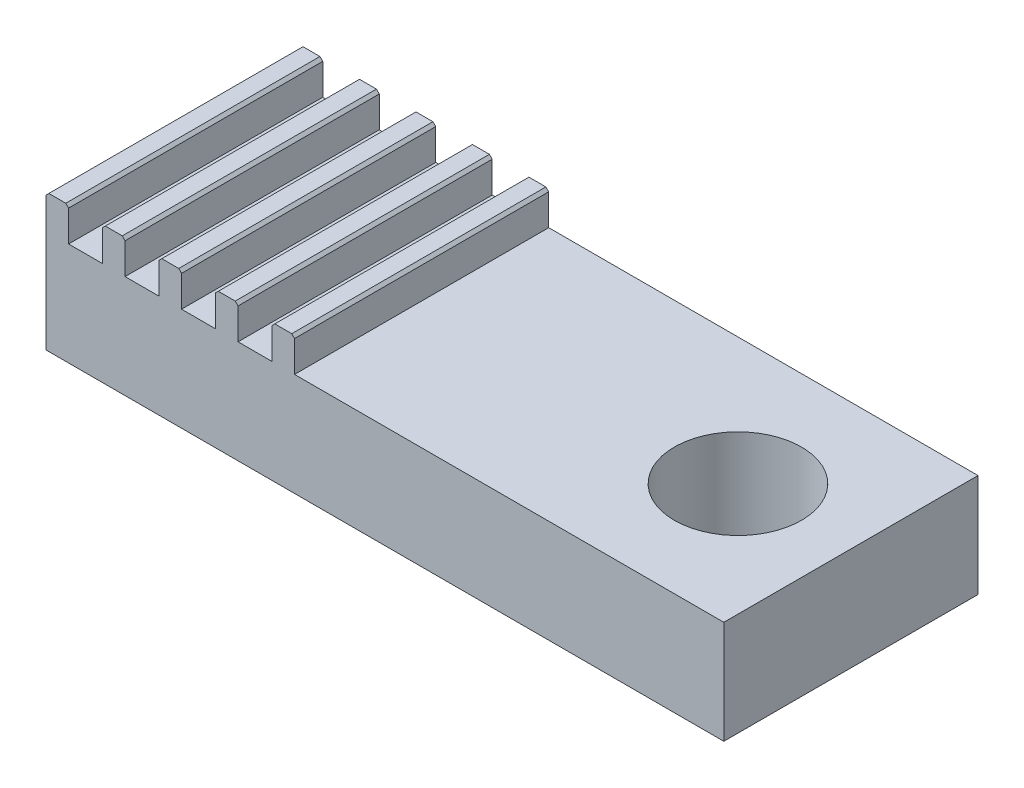
ISO-10303-21;
HEADER;
FILE_DESCRIPTION(('STEP AP214'),'2;1');
FILE_NAME('part.step','',(''),(''),'','','');
FILE_SCHEMA(('AUTOMOTIVE_DESIGN { 1 0 10303 214 1 1 1 1 }'));
ENDSEC;
DATA;
#1=APPLICATION_CONTEXT('core data for automotive mechanical design processes');
#2=APPLICATION_PROTOCOL_DEFINITION('international standard','automotive_design',2000,#1);
#3=PRODUCT_CONTEXT('',#1,'mechanical');
#4=PRODUCT('Part','Part','',(#3));
#5=PRODUCT_RELATED_PRODUCT_CATEGORY('part','',(#4));
#6=PRODUCT_DEFINITION_FORMATION('','',#4);
#7=PRODUCT_DEFINITION_CONTEXT('part definition',#1,'design');
#8=PRODUCT_DEFINITION('design','',#6,#7);
#9=PRODUCT_DEFINITION_SHAPE('','',#8);
#10=(LENGTH_UNIT() NAMED_UNIT(*) SI_UNIT(.MILLI.,.METRE.));
#11=(NAMED_UNIT(*) PLANE_ANGLE_UNIT() SI_UNIT($,.RADIAN.));
#12=(NAMED_UNIT(*) SI_UNIT($,.STERADIAN.) SOLID_ANGLE_UNIT());
#13=UNCERTAINTY_MEASURE_WITH_UNIT(LENGTH_MEASURE(1.E-05),#10,'distance_accuracy_value','');
#14=(GEOMETRIC_REPRESENTATION_CONTEXT(3) GLOBAL_UNCERTAINTY_ASSIGNED_CONTEXT((#13)) GLOBAL_UNIT_ASSIGNED_CONTEXT((#10,
#11,#12)) REPRESENTATION_CONTEXT('',''));
#15=CARTESIAN_POINT('',(0.,0.,0.));
#16=DIRECTION('',(0.,0.,1.));
#17=DIRECTION('',(1.,0.,0.));
#18=AXIS2_PLACEMENT_3D('',#15,#16,#17);
#19=CARTESIAN_POINT('',(4.,0.,9.));
#20=DIRECTION('',(0.,1.,0.));
#21=DIRECTION('',(0.,0.,1.));
#22=AXIS2_PLACEMENT_3D('',#19,#20,#21);
#23=PLANE('',#22);
#24=CARTESIAN_POINT('',(24.,0.,4.5));
#25=DIRECTION('',(0.,1.,0.));
#26=DIRECTION('',(0.,0.,1.));
#27=AXIS2_PLACEMENT_3D('',#24,#25,#26);
#28=CIRCLE('',#27,2.25);
#29=CARTESIAN_POINT('',(24.,0.,6.75));
#30=VERTEX_POINT('',#29);
#31=EDGE_CURVE('E496',#30,#30,#28,.T.);
#32=ORIENTED_EDGE('',*,*,#31,.T.);
#33=EDGE_LOOP('',(#32));
#34=FACE_BOUND('',#33,.T.);
#35=DIRECTION('',(1.,0.,0.));
#36=VECTOR('',#35,1.);
#37=CARTESIAN_POINT('',(4.,0.,0.));
#38=LINE('',#37,#36);
#39=CARTESIAN_POINT('',(4.,0.,0.));
#40=VERTEX_POINT('',#39);
#41=CARTESIAN_POINT('',(28.,0.,0.));
#42=VERTEX_POINT('',#41);
#43=EDGE_CURVE('E267',#40,#42,#38,.T.);
#44=ORIENTED_EDGE('',*,*,#43,.T.);
#45=DIRECTION('',(0.,0.,-1.));
#46=VECTOR('',#45,1.);
#47=CARTESIAN_POINT('',(28.,0.,9.));
#48=LINE('',#47,#46);
#49=CARTESIAN_POINT('',(28.,0.,9.));
#50=VERTEX_POINT('',#49);
#51=EDGE_CURVE('E249',#50,#42,#48,.T.);
#52=ORIENTED_EDGE('',*,*,#51,.F.);
#53=DIRECTION('',(1.,0.,0.));
#54=VECTOR('',#53,1.);
#55=CARTESIAN_POINT('',(4.,0.,9.));
#56=LINE('',#55,#54);
#57=CARTESIAN_POINT('',(4.,0.,9.));
#58=VERTEX_POINT('',#57);
#59=EDGE_CURVE('E255',#58,#50,#56,.T.);
#60=ORIENTED_EDGE('',*,*,#59,.F.);
#61=DIRECTION('',(0.,0.,-1.));
#62=VECTOR('',#61,1.);
#63=CARTESIAN_POINT('',(4.,0.,9.));
#64=LINE('',#63,#62);
#65=EDGE_CURVE('E387',#58,#40,#64,.T.);
#66=ORIENTED_EDGE('',*,*,#65,.T.);
#67=EDGE_LOOP('',(#44,#52,#60,#66));
#68=FACE_BOUND('',#67,.T.);
#69=ADVANCED_FACE('F34',(#34,#68),#23,.F.);
#70=CARTESIAN_POINT('',(28.,3.65,9.));
#71=DIRECTION('',(-1.,0.,0.));
#72=DIRECTION('',(0.,0.,1.));
#73=AXIS2_PLACEMENT_3D('',#70,#71,#72);
#74=PLANE('',#73);
#75=DIRECTION('',(0.,1.,0.));
#76=VECTOR('',#75,1.);
#77=CARTESIAN_POINT('',(28.,3.65,0.));
#78=LINE('',#77,#76);
#79=CARTESIAN_POINT('',(28.,3.65,0.));
#80=VERTEX_POINT('',#79);
#81=EDGE_CURVE('E429',#42,#80,#78,.T.);
#82=ORIENTED_EDGE('',*,*,#81,.T.);
#83=DIRECTION('',(0.,0.,-1.));
#84=VECTOR('',#83,1.);
#85=CARTESIAN_POINT('',(28.,3.65,9.));
#86=LINE('',#85,#84);
#87=CARTESIAN_POINT('',(28.,3.65,9.));
#88=VERTEX_POINT('',#87);
#89=EDGE_CURVE('E252',#88,#80,#86,.T.);
#90=ORIENTED_EDGE('',*,*,#89,.F.);
#91=DIRECTION('',(0.,1.,0.));
#92=VECTOR('',#91,1.);
#93=CARTESIAN_POINT('',(28.,3.65,9.));
#94=LINE('',#93,#92);
#95=EDGE_CURVE('E245',#50,#88,#94,.T.);
#96=ORIENTED_EDGE('',*,*,#95,.F.);
#97=ORIENTED_EDGE('',*,*,#51,.T.);
#98=EDGE_LOOP('',(#82,#90,#96,#97));
#99=FACE_BOUND('',#98,.T.);
#100=ADVANCED_FACE('F247',(#99),#74,.F.);
#101=CARTESIAN_POINT('',(12.8,3.65,9.));
#102=DIRECTION('',(0.,-1.,0.));
#103=DIRECTION('',(1.,0.,0.));
#104=AXIS2_PLACEMENT_3D('',#101,#102,#103);
#105=PLANE('',#104);
#106=CARTESIAN_POINT('',(24.,3.65,4.5));
#107=DIRECTION('',(0.,1.,0.));
#108=DIRECTION('',(0.,0.,1.));
#109=AXIS2_PLACEMENT_3D('',#106,#107,#108);
#110=CIRCLE('',#109,2.25);
#111=CARTESIAN_POINT('',(24.,3.65,6.75));
#112=VERTEX_POINT('',#111);
#113=EDGE_CURVE('E683',#112,#112,#110,.T.);
#114=ORIENTED_EDGE('',*,*,#113,.F.);
#115=EDGE_LOOP('',(#114));
#116=FACE_BOUND('',#115,.T.);
#117=DIRECTION('',(-1.,0.,0.));
#118=VECTOR('',#117,1.);
#119=CARTESIAN_POINT('',(12.8,3.65,0.));
#120=LINE('',#119,#118);
#121=CARTESIAN_POINT('',(12.8,3.65,0.));
#122=VERTEX_POINT('',#121);
#123=EDGE_CURVE('E423',#80,#122,#120,.T.);
#124=ORIENTED_EDGE('',*,*,#123,.T.);
#125=DIRECTION('',(0.,0.,-1.));
#126=VECTOR('',#125,1.);
#127=CARTESIAN_POINT('',(12.8,3.65,9.));
#128=LINE('',#127,#126);
#129=CARTESIAN_POINT('',(12.8,3.65,9.));
#130=VERTEX_POINT('',#129);
#131=EDGE_CURVE('E272',#130,#122,#128,.T.);
#132=ORIENTED_EDGE('',*,*,#131,.F.);
#133=DIRECTION('',(-1.,0.,0.));
#134=VECTOR('',#133,1.);
#135=CARTESIAN_POINT('',(12.8,3.65,9.));
#136=LINE('',#135,#134);
#137=EDGE_CURVE('E254',#88,#130,#136,.T.);
#138=ORIENTED_EDGE('',*,*,#137,.F.);
#139=ORIENTED_EDGE('',*,*,#89,.T.);
#140=EDGE_LOOP('',(#124,#132,#138,#139));
#141=FACE_BOUND('',#140,.T.);
#142=ADVANCED_FACE('F497',(#116,#141),#105,.F.);
#143=CARTESIAN_POINT('',(12.8,4.85,9.));
#144=DIRECTION('',(-1.,0.,0.));
#145=DIRECTION('',(0.,-1.,0.));
#146=AXIS2_PLACEMENT_3D('',#143,#144,#145);
#147=PLANE('',#146);
#148=DIRECTION('',(0.,1.,0.));
#149=VECTOR('',#148,1.);
#150=CARTESIAN_POINT('',(12.8,4.85,0.));
#151=LINE('',#150,#149);
#152=CARTESIAN_POINT('',(12.8,4.75,0.));
#153=VERTEX_POINT('',#152);
#154=EDGE_CURVE('E418',#122,#153,#151,.T.);
#155=ORIENTED_EDGE('',*,*,#154,.T.);
#156=DIRECTION('',(0.,0.,1.));
#157=VECTOR('',#156,1.);
#158=CARTESIAN_POINT('',(12.8,4.75,9.));
#159=LINE('',#158,#157);
#160=CARTESIAN_POINT('',(12.8,4.75,9.));
#161=VERTEX_POINT('',#160);
#162=EDGE_CURVE('E298',#153,#161,#159,.T.);
#163=ORIENTED_EDGE('',*,*,#162,.T.);
#164=DIRECTION('',(0.,1.,0.));
#165=VECTOR('',#164,1.);
#166=CARTESIAN_POINT('',(12.8,4.85,9.));
#167=LINE('',#166,#165);
#168=EDGE_CURVE('E420',#130,#161,#167,.T.);
#169=ORIENTED_EDGE('',*,*,#168,.F.);
#170=ORIENTED_EDGE('',*,*,#131,.T.);
#171=EDGE_LOOP('',(#155,#163,#169,#170));
#172=FACE_BOUND('',#171,.T.);
#173=ADVANCED_FACE('F417',(#172),#147,.F.);
#174=CARTESIAN_POINT('',(12.,4.85,9.));
#175=DIRECTION('',(0.,-1.,0.));
#176=DIRECTION('',(0.,0.,-1.));
#177=AXIS2_PLACEMENT_3D('',#174,#175,#176);
#178=PLANE('',#177);
#179=DIRECTION('',(-1.,0.,0.));
#180=VECTOR('',#179,1.);
#181=CARTESIAN_POINT('',(12.,4.85,9.));
#182=LINE('',#181,#180);
#183=CARTESIAN_POINT('',(12.7,4.85,9.));
#184=VERTEX_POINT('',#183);
#185=CARTESIAN_POINT('',(12.1,4.85,9.));
#186=VERTEX_POINT('',#185);
#187=EDGE_CURVE('E499',#184,#186,#182,.T.);
#188=ORIENTED_EDGE('',*,*,#187,.F.);
#189=DIRECTION('',(0.,0.,-1.));
#190=VECTOR('',#189,1.);
#191=CARTESIAN_POINT('',(12.7,4.85,9.));
#192=LINE('',#191,#190);
#193=CARTESIAN_POINT('',(12.7,4.85,0.));
#194=VERTEX_POINT('',#193);
#195=EDGE_CURVE('E270',#184,#194,#192,.T.);
#196=ORIENTED_EDGE('',*,*,#195,.T.);
#197=DIRECTION('',(-1.,0.,0.));
#198=VECTOR('',#197,1.);
#199=CARTESIAN_POINT('',(12.,4.85,0.));
#200=LINE('',#199,#198);
#201=CARTESIAN_POINT('',(12.1,4.85,0.));
#202=VERTEX_POINT('',#201);
#203=EDGE_CURVE('E424',#194,#202,#200,.T.);
#204=ORIENTED_EDGE('',*,*,#203,.T.);
#205=DIRECTION('',(0.,0.,1.));
#206=VECTOR('',#205,1.);
#207=CARTESIAN_POINT('',(12.1,4.85,9.));
#208=LINE('',#207,#206);
#209=EDGE_CURVE('E268',#202,#186,#208,.T.);
#210=ORIENTED_EDGE('',*,*,#209,.T.);
#211=EDGE_LOOP('',(#188,#196,#204,#210));
#212=FACE_BOUND('',#211,.T.);
#213=ADVANCED_FACE('F605',(#212),#178,.F.);
#214=CARTESIAN_POINT('',(12.,3.65,9.));
#215=DIRECTION('',(1.,0.,0.));
#216=DIRECTION('',(0.,1.,0.));
#217=AXIS2_PLACEMENT_3D('',#214,#215,#216);
#218=PLANE('',#217);
#219=DIRECTION('',(0.,-1.,0.));
#220=VECTOR('',#219,1.);
#221=CARTESIAN_POINT('',(12.,3.65,9.));
#222=LINE('',#221,#220);
#223=CARTESIAN_POINT('',(12.,4.75,9.));
#224=VERTEX_POINT('',#223);
#225=CARTESIAN_POINT('',(12.,3.65,9.));
#226=VERTEX_POINT('',#225);
#227=EDGE_CURVE('E504',#224,#226,#222,.T.);
#228=ORIENTED_EDGE('',*,*,#227,.F.);
#229=DIRECTION('',(0.,0.,-1.));
#230=VECTOR('',#229,1.);
#231=CARTESIAN_POINT('',(12.,4.75,9.));
#232=LINE('',#231,#230);
#233=CARTESIAN_POINT('',(12.,4.75,0.));
#234=VERTEX_POINT('',#233);
#235=EDGE_CURVE('E319',#224,#234,#232,.T.);
#236=ORIENTED_EDGE('',*,*,#235,.T.);
#237=DIRECTION('',(0.,-1.,0.));
#238=VECTOR('',#237,1.);
#239=CARTESIAN_POINT('',(12.,3.65,0.));
#240=LINE('',#239,#238);
#241=CARTESIAN_POINT('',(12.,3.65,0.));
#242=VERTEX_POINT('',#241);
#243=EDGE_CURVE('E427',#234,#242,#240,.T.);
#244=ORIENTED_EDGE('',*,*,#243,.T.);
#245=DIRECTION('',(0.,0.,-1.));
#246=VECTOR('',#245,1.);
#247=CARTESIAN_POINT('',(12.,3.65,9.));
#248=LINE('',#247,#246);
#249=EDGE_CURVE('E409',#226,#242,#248,.T.);
#250=ORIENTED_EDGE('',*,*,#249,.F.);
#251=EDGE_LOOP('',(#228,#236,#244,#250));
#252=FACE_BOUND('',#251,.T.);
#253=ADVANCED_FACE('F597',(#252),#218,.F.);
#254=CARTESIAN_POINT('',(10.8,3.65,9.));
#255=DIRECTION('',(0.,-1.,0.));
#256=DIRECTION('',(0.,0.,-1.));
#257=AXIS2_PLACEMENT_3D('',#254,#255,#256);
#258=PLANE('',#257);
#259=DIRECTION('',(-1.,0.,0.));
#260=VECTOR('',#259,1.);
#261=CARTESIAN_POINT('',(10.8,3.65,0.));
#262=LINE('',#261,#260);
#263=CARTESIAN_POINT('',(10.8,3.65,0.));
#264=VERTEX_POINT('',#263);
#265=EDGE_CURVE('E434',#242,#264,#262,.T.);
#266=ORIENTED_EDGE('',*,*,#265,.T.);
#267=DIRECTION('',(0.,0.,-1.));
#268=VECTOR('',#267,1.);
#269=CARTESIAN_POINT('',(10.8,3.65,9.));
#270=LINE('',#269,#268);
#271=CARTESIAN_POINT('',(10.8,3.65,9.));
#272=VERTEX_POINT('',#271);
#273=EDGE_CURVE('E406',#272,#264,#270,.T.);
#274=ORIENTED_EDGE('',*,*,#273,.F.);
#275=DIRECTION('',(-1.,0.,0.));
#276=VECTOR('',#275,1.);
#277=CARTESIAN_POINT('',(10.8,3.65,9.));
#278=LINE('',#277,#276);
#279=EDGE_CURVE('E506',#226,#272,#278,.T.);
#280=ORIENTED_EDGE('',*,*,#279,.F.);
#281=ORIENTED_EDGE('',*,*,#249,.T.);
#282=EDGE_LOOP('',(#266,#274,#280,#281));
#283=FACE_BOUND('',#282,.T.);
#284=ADVANCED_FACE('F592',(#283),#258,.F.);
#285=CARTESIAN_POINT('',(10.8,4.85,9.));
#286=DIRECTION('',(-1.,0.,0.));
#287=DIRECTION('',(0.,-1.,0.));
#288=AXIS2_PLACEMENT_3D('',#285,#286,#287);
#289=PLANE('',#288);
#290=DIRECTION('',(0.,1.,0.));
#291=VECTOR('',#290,1.);
#292=CARTESIAN_POINT('',(10.8,4.85,0.));
#293=LINE('',#292,#291);
#294=CARTESIAN_POINT('',(10.8,4.75,0.));
#295=VERTEX_POINT('',#294);
#296=EDGE_CURVE('E436',#264,#295,#293,.T.);
#297=ORIENTED_EDGE('',*,*,#296,.T.);
#298=DIRECTION('',(0.,0.,1.));
#299=VECTOR('',#298,1.);
#300=CARTESIAN_POINT('',(10.8,4.75,9.));
#301=LINE('',#300,#299);
#302=CARTESIAN_POINT('',(10.8,4.75,9.));
#303=VERTEX_POINT('',#302);
#304=EDGE_CURVE('E327',#295,#303,#301,.T.);
#305=ORIENTED_EDGE('',*,*,#304,.T.);
#306=DIRECTION('',(0.,1.,0.));
#307=VECTOR('',#306,1.);
#308=CARTESIAN_POINT('',(10.8,4.85,9.));
#309=LINE('',#308,#307);
#310=EDGE_CURVE('E508',#272,#303,#309,.T.);
#311=ORIENTED_EDGE('',*,*,#310,.F.);
#312=ORIENTED_EDGE('',*,*,#273,.T.);
#313=EDGE_LOOP('',(#297,#305,#311,#312));
#314=FACE_BOUND('',#313,.T.);
#315=ADVANCED_FACE('F588',(#314),#289,.F.);
#316=CARTESIAN_POINT('',(10.,4.85,9.));
#317=DIRECTION('',(0.,-1.,0.));
#318=DIRECTION('',(0.,0.,-1.));
#319=AXIS2_PLACEMENT_3D('',#316,#317,#318);
#320=PLANE('',#319);
#321=DIRECTION('',(-1.,0.,0.));
#322=VECTOR('',#321,1.);
#323=CARTESIAN_POINT('',(10.,4.85,9.));
#324=LINE('',#323,#322);
#325=CARTESIAN_POINT('',(10.7,4.85,9.));
#326=VERTEX_POINT('',#325);
#327=CARTESIAN_POINT('',(10.1,4.85,9.));
#328=VERTEX_POINT('',#327);
#329=EDGE_CURVE('E511',#326,#328,#324,.T.);
#330=ORIENTED_EDGE('',*,*,#329,.F.);
#331=DIRECTION('',(0.,0.,-1.));
#332=VECTOR('',#331,1.);
#333=CARTESIAN_POINT('',(10.7,4.85,9.));
#334=LINE('',#333,#332);
#335=CARTESIAN_POINT('',(10.7,4.85,0.));
#336=VERTEX_POINT('',#335);
#337=EDGE_CURVE('E324',#326,#336,#334,.T.);
#338=ORIENTED_EDGE('',*,*,#337,.T.);
#339=DIRECTION('',(-1.,0.,0.));
#340=VECTOR('',#339,1.);
#341=CARTESIAN_POINT('',(10.,4.85,0.));
#342=LINE('',#341,#340);
#343=CARTESIAN_POINT('',(10.1,4.85,0.));
#344=VERTEX_POINT('',#343);
#345=EDGE_CURVE('E439',#336,#344,#342,.T.);
#346=ORIENTED_EDGE('',*,*,#345,.T.);
#347=DIRECTION('',(0.,0.,1.));
#348=VECTOR('',#347,1.);
#349=CARTESIAN_POINT('',(10.1,4.85,9.));
#350=LINE('',#349,#348);
#351=EDGE_CURVE('E322',#344,#328,#350,.T.);
#352=ORIENTED_EDGE('',*,*,#351,.T.);
#353=EDGE_LOOP('',(#330,#338,#346,#352));
#354=FACE_BOUND('',#353,.T.);
#355=ADVANCED_FACE('F578',(#354),#320,.F.);
#356=CARTESIAN_POINT('',(10.,3.65,9.));
#357=DIRECTION('',(1.,0.,0.));
#358=DIRECTION('',(0.,0.,-1.));
#359=AXIS2_PLACEMENT_3D('',#356,#357,#358);
#360=PLANE('',#359);
#361=DIRECTION('',(0.,-1.,0.));
#362=VECTOR('',#361,1.);
#363=CARTESIAN_POINT('',(10.,3.65,9.));
#364=LINE('',#363,#362);
#365=CARTESIAN_POINT('',(10.,4.75,9.));
#366=VERTEX_POINT('',#365);
#367=CARTESIAN_POINT('',(10.,3.65,9.));
#368=VERTEX_POINT('',#367);
#369=EDGE_CURVE('E514',#366,#368,#364,.T.);
#370=ORIENTED_EDGE('',*,*,#369,.F.);
#371=DIRECTION('',(0.,0.,-1.));
#372=VECTOR('',#371,1.);
#373=CARTESIAN_POINT('',(10.,4.75,9.));
#374=LINE('',#373,#372);
#375=CARTESIAN_POINT('',(10.,4.75000000000001,0.));
#376=VERTEX_POINT('',#375);
#377=EDGE_CURVE('E329',#366,#376,#374,.T.);
#378=ORIENTED_EDGE('',*,*,#377,.T.);
#379=DIRECTION('',(0.,-1.,0.));
#380=VECTOR('',#379,1.);
#381=CARTESIAN_POINT('',(10.,3.65,0.));
#382=LINE('',#381,#380);
#383=CARTESIAN_POINT('',(10.,3.65,0.));
#384=VERTEX_POINT('',#383);
#385=EDGE_CURVE('E442',#376,#384,#382,.T.);
#386=ORIENTED_EDGE('',*,*,#385,.T.);
#387=DIRECTION('',(0.,0.,-1.));
#388=VECTOR('',#387,1.);
#389=CARTESIAN_POINT('',(10.,3.65,9.));
#390=LINE('',#389,#388);
#391=EDGE_CURVE('E403',#368,#384,#390,.T.);
#392=ORIENTED_EDGE('',*,*,#391,.F.);
#393=EDGE_LOOP('',(#370,#378,#386,#392));
#394=FACE_BOUND('',#393,.T.);
#395=ADVANCED_FACE('F570',(#394),#360,.F.);
#396=CARTESIAN_POINT('',(8.8,3.65,9.));
#397=DIRECTION('',(0.,-1.,0.));
#398=DIRECTION('',(1.,0.,0.));
#399=AXIS2_PLACEMENT_3D('',#396,#397,#398);
#400=PLANE('',#399);
#401=DIRECTION('',(-1.,0.,0.));
#402=VECTOR('',#401,1.);
#403=CARTESIAN_POINT('',(8.8,3.65,0.));
#404=LINE('',#403,#402);
#405=CARTESIAN_POINT('',(8.8,3.65,0.));
#406=VERTEX_POINT('',#405);
#407=EDGE_CURVE('E444',#384,#406,#404,.T.);
#408=ORIENTED_EDGE('',*,*,#407,.T.);
#409=DIRECTION('',(0.,0.,-1.));
#410=VECTOR('',#409,1.);
#411=CARTESIAN_POINT('',(8.8,3.65,9.));
#412=LINE('',#411,#410);
#413=CARTESIAN_POINT('',(8.8,3.65,9.));
#414=VERTEX_POINT('',#413);
#415=EDGE_CURVE('E400',#414,#406,#412,.T.);
#416=ORIENTED_EDGE('',*,*,#415,.F.);
#417=DIRECTION('',(-1.,0.,0.));
#418=VECTOR('',#417,1.);
#419=CARTESIAN_POINT('',(8.8,3.65,9.));
#420=LINE('',#419,#418);
#421=EDGE_CURVE('E516',#368,#414,#420,.T.);
#422=ORIENTED_EDGE('',*,*,#421,.F.);
#423=ORIENTED_EDGE('',*,*,#391,.T.);
#424=EDGE_LOOP('',(#408,#416,#422,#423));
#425=FACE_BOUND('',#424,.T.);
#426=ADVANCED_FACE('F564',(#425),#400,.F.);
#427=CARTESIAN_POINT('',(8.8,4.85,9.));
#428=DIRECTION('',(-1.,0.,0.));
#429=DIRECTION('',(0.,0.,1.));
#430=AXIS2_PLACEMENT_3D('',#427,#428,#429);
#431=PLANE('',#430);
#432=DIRECTION('',(0.,1.,0.));
#433=VECTOR('',#432,1.);
#434=CARTESIAN_POINT('',(8.8,4.85,0.));
#435=LINE('',#434,#433);
#436=CARTESIAN_POINT('',(8.8,4.75,0.));
#437=VERTEX_POINT('',#436);
#438=EDGE_CURVE('E446',#406,#437,#435,.T.);
#439=ORIENTED_EDGE('',*,*,#438,.T.);
#440=DIRECTION('',(0.,0.,1.));
#441=VECTOR('',#440,1.);
#442=CARTESIAN_POINT('',(8.8,4.75,9.));
#443=LINE('',#442,#441);
#444=CARTESIAN_POINT('',(8.8,4.75,9.));
#445=VERTEX_POINT('',#444);
#446=EDGE_CURVE('E337',#437,#445,#443,.T.);
#447=ORIENTED_EDGE('',*,*,#446,.T.);
#448=DIRECTION('',(0.,1.,0.));
#449=VECTOR('',#448,1.);
#450=CARTESIAN_POINT('',(8.8,4.85,9.));
#451=LINE('',#450,#449);
#452=EDGE_CURVE('E518',#414,#445,#451,.T.);
#453=ORIENTED_EDGE('',*,*,#452,.F.);
#454=ORIENTED_EDGE('',*,*,#415,.T.);
#455=EDGE_LOOP('',(#439,#447,#453,#454));
#456=FACE_BOUND('',#455,.T.);
#457=ADVANCED_FACE('F560',(#456),#431,.F.);
#458=CARTESIAN_POINT('',(8.,4.85,9.));
#459=DIRECTION('',(0.,-1.,0.));
#460=DIRECTION('',(0.,0.,-1.));
#461=AXIS2_PLACEMENT_3D('',#458,#459,#460);
#462=PLANE('',#461);
#463=DIRECTION('',(-1.,0.,0.));
#464=VECTOR('',#463,1.);
#465=CARTESIAN_POINT('',(8.,4.85,9.));
#466=LINE('',#465,#464);
#467=CARTESIAN_POINT('',(8.7,4.85,9.));
#468=VERTEX_POINT('',#467);
#469=CARTESIAN_POINT('',(8.1,4.85,9.));
#470=VERTEX_POINT('',#469);
#471=EDGE_CURVE('E521',#468,#470,#466,.T.);
#472=ORIENTED_EDGE('',*,*,#471,.F.);
#473=DIRECTION('',(0.,0.,-1.));
#474=VECTOR('',#473,1.);
#475=CARTESIAN_POINT('',(8.7,4.85,9.));
#476=LINE('',#475,#474);
#477=CARTESIAN_POINT('',(8.7,4.85,0.));
#478=VERTEX_POINT('',#477);
#479=EDGE_CURVE('E334',#468,#478,#476,.T.);
#480=ORIENTED_EDGE('',*,*,#479,.T.);
#481=DIRECTION('',(-1.,0.,0.));
#482=VECTOR('',#481,1.);
#483=CARTESIAN_POINT('',(8.,4.85,0.));
#484=LINE('',#483,#482);
#485=CARTESIAN_POINT('',(8.1,4.85,0.));
#486=VERTEX_POINT('',#485);
#487=EDGE_CURVE('E449',#478,#486,#484,.T.);
#488=ORIENTED_EDGE('',*,*,#487,.T.);
#489=DIRECTION('',(0.,0.,1.));
#490=VECTOR('',#489,1.);
#491=CARTESIAN_POINT('',(8.1,4.85,9.));
#492=LINE('',#491,#490);
#493=EDGE_CURVE('E332',#486,#470,#492,.T.);
#494=ORIENTED_EDGE('',*,*,#493,.T.);
#495=EDGE_LOOP('',(#472,#480,#488,#494));
#496=FACE_BOUND('',#495,.T.);
#497=ADVANCED_FACE('F550',(#496),#462,.F.);
#498=CARTESIAN_POINT('',(8.,3.65,9.));
#499=DIRECTION('',(1.,0.,0.));
#500=DIRECTION('',(0.,0.,-1.));
#501=AXIS2_PLACEMENT_3D('',#498,#499,#500);
#502=PLANE('',#501);
#503=DIRECTION('',(0.,-1.,0.));
#504=VECTOR('',#503,1.);
#505=CARTESIAN_POINT('',(8.,3.65,9.));
#506=LINE('',#505,#504);
#507=CARTESIAN_POINT('',(8.,4.75,9.));
#508=VERTEX_POINT('',#507);
#509=CARTESIAN_POINT('',(8.,3.65,9.));
#510=VERTEX_POINT('',#509);
#511=EDGE_CURVE('E524',#508,#510,#506,.T.);
#512=ORIENTED_EDGE('',*,*,#511,.F.);
#513=DIRECTION('',(0.,0.,-1.));
#514=VECTOR('',#513,1.);
#515=CARTESIAN_POINT('',(8.,4.75,9.));
#516=LINE('',#515,#514);
#517=CARTESIAN_POINT('',(8.,4.75,0.));
#518=VERTEX_POINT('',#517);
#519=EDGE_CURVE('E339',#508,#518,#516,.T.);
#520=ORIENTED_EDGE('',*,*,#519,.T.);
#521=DIRECTION('',(0.,-1.,0.));
#522=VECTOR('',#521,1.);
#523=CARTESIAN_POINT('',(8.,3.65,0.));
#524=LINE('',#523,#522);
#525=CARTESIAN_POINT('',(8.,3.65,0.));
#526=VERTEX_POINT('',#525);
#527=EDGE_CURVE('E452',#518,#526,#524,.T.);
#528=ORIENTED_EDGE('',*,*,#527,.T.);
#529=DIRECTION('',(0.,0.,-1.));
#530=VECTOR('',#529,1.);
#531=CARTESIAN_POINT('',(8.,3.65,9.));
#532=LINE('',#531,#530);
#533=EDGE_CURVE('E397',#510,#526,#532,.T.);
#534=ORIENTED_EDGE('',*,*,#533,.F.);
#535=EDGE_LOOP('',(#512,#520,#528,#534));
#536=FACE_BOUND('',#535,.T.);
#537=ADVANCED_FACE('F542',(#536),#502,.F.);
#538=CARTESIAN_POINT('',(6.8,3.65,9.));
#539=DIRECTION('',(0.,-1.,0.));
#540=DIRECTION('',(0.,0.,-1.));
#541=AXIS2_PLACEMENT_3D('',#538,#539,#540);
#542=PLANE('',#541);
#543=DIRECTION('',(-1.,0.,0.));
#544=VECTOR('',#543,1.);
#545=CARTESIAN_POINT('',(6.8,3.65,0.));
#546=LINE('',#545,#544);
#547=CARTESIAN_POINT('',(6.8,3.65,0.));
#548=VERTEX_POINT('',#547);
#549=EDGE_CURVE('E454',#526,#548,#546,.T.);
#550=ORIENTED_EDGE('',*,*,#549,.T.);
#551=DIRECTION('',(0.,0.,-1.));
#552=VECTOR('',#551,1.);
#553=CARTESIAN_POINT('',(6.8,3.65,9.));
#554=LINE('',#553,#552);
#555=CARTESIAN_POINT('',(6.8,3.65,9.));
#556=VERTEX_POINT('',#555);
#557=EDGE_CURVE('E394',#556,#548,#554,.T.);
#558=ORIENTED_EDGE('',*,*,#557,.F.);
#559=DIRECTION('',(-1.,0.,0.));
#560=VECTOR('',#559,1.);
#561=CARTESIAN_POINT('',(6.8,3.65,9.));
#562=LINE('',#561,#560);
#563=EDGE_CURVE('E489',#510,#556,#562,.T.);
#564=ORIENTED_EDGE('',*,*,#563,.F.);
#565=ORIENTED_EDGE('',*,*,#533,.T.);
#566=EDGE_LOOP('',(#550,#558,#564,#565));
#567=FACE_BOUND('',#566,.T.);
#568=ADVANCED_FACE('F531',(#567),#542,.F.);
#569=CARTESIAN_POINT('',(6.8,4.85,9.));
#570=DIRECTION('',(-1.,0.,0.));
#571=DIRECTION('',(0.,0.,1.));
#572=AXIS2_PLACEMENT_3D('',#569,#570,#571);
#573=PLANE('',#572);
#574=DIRECTION('',(0.,1.,0.));
#575=VECTOR('',#574,1.);
#576=CARTESIAN_POINT('',(6.8,4.85,0.));
#577=LINE('',#576,#575);
#578=CARTESIAN_POINT('',(6.8,4.75,0.));
#579=VERTEX_POINT('',#578);
#580=EDGE_CURVE('E456',#548,#579,#577,.T.);
#581=ORIENTED_EDGE('',*,*,#580,.T.);
#582=DIRECTION('',(0.,0.,1.));
#583=VECTOR('',#582,1.);
#584=CARTESIAN_POINT('',(6.8,4.75,9.));
#585=LINE('',#584,#583);
#586=CARTESIAN_POINT('',(6.8,4.75,9.));
#587=VERTEX_POINT('',#586);
#588=EDGE_CURVE('E347',#579,#587,#585,.T.);
#589=ORIENTED_EDGE('',*,*,#588,.T.);
#590=DIRECTION('',(0.,1.,0.));
#591=VECTOR('',#590,1.);
#592=CARTESIAN_POINT('',(6.8,4.85,9.));
#593=LINE('',#592,#591);
#594=EDGE_CURVE('E486',#556,#587,#593,.T.);
#595=ORIENTED_EDGE('',*,*,#594,.F.);
#596=ORIENTED_EDGE('',*,*,#557,.T.);
#597=EDGE_LOOP('',(#581,#589,#595,#596));
#598=FACE_BOUND('',#597,.T.);
#599=ADVANCED_FACE('F535',(#598),#573,.F.);
#600=CARTESIAN_POINT('',(6.,4.85,9.));
#601=DIRECTION('',(0.,-1.,0.));
#602=DIRECTION('',(0.,0.,-1.));
#603=AXIS2_PLACEMENT_3D('',#600,#601,#602);
#604=PLANE('',#603);
#605=DIRECTION('',(-1.,0.,0.));
#606=VECTOR('',#605,1.);
#607=CARTESIAN_POINT('',(6.,4.85,9.));
#608=LINE('',#607,#606);
#609=CARTESIAN_POINT('',(6.7,4.85,9.));
#610=VERTEX_POINT('',#609);
#611=CARTESIAN_POINT('',(6.1,4.85,9.));
#612=VERTEX_POINT('',#611);
#613=EDGE_CURVE('E482',#610,#612,#608,.T.);
#614=ORIENTED_EDGE('',*,*,#613,.F.);
#615=DIRECTION('',(0.,0.,-1.));
#616=VECTOR('',#615,1.);
#617=CARTESIAN_POINT('',(6.7,4.85,9.));
#618=LINE('',#617,#616);
#619=CARTESIAN_POINT('',(6.7,4.85,0.));
#620=VERTEX_POINT('',#619);
#621=EDGE_CURVE('E344',#610,#620,#618,.T.);
#622=ORIENTED_EDGE('',*,*,#621,.T.);
#623=DIRECTION('',(-1.,0.,0.));
#624=VECTOR('',#623,1.);
#625=CARTESIAN_POINT('',(6.,4.85,0.));
#626=LINE('',#625,#624);
#627=CARTESIAN_POINT('',(6.1,4.85,0.));
#628=VERTEX_POINT('',#627);
#629=EDGE_CURVE('E459',#620,#628,#626,.T.);
#630=ORIENTED_EDGE('',*,*,#629,.T.);
#631=DIRECTION('',(0.,0.,1.));
#632=VECTOR('',#631,1.);
#633=CARTESIAN_POINT('',(6.1,4.85,9.));
#634=LINE('',#633,#632);
#635=EDGE_CURVE('E342',#628,#612,#634,.T.);
#636=ORIENTED_EDGE('',*,*,#635,.T.);
#637=EDGE_LOOP('',(#614,#622,#630,#636));
#638=FACE_BOUND('',#637,.T.);
#639=ADVANCED_FACE('F481',(#638),#604,.F.);
#640=CARTESIAN_POINT('',(6.,3.65,9.));
#641=DIRECTION('',(1.,0.,0.));
#642=DIRECTION('',(0.,1.,0.));
#643=AXIS2_PLACEMENT_3D('',#640,#641,#642);
#644=PLANE('',#643);
#645=DIRECTION('',(0.,-1.,0.));
#646=VECTOR('',#645,1.);
#647=CARTESIAN_POINT('',(6.,3.65,9.));
#648=LINE('',#647,#646);
#649=CARTESIAN_POINT('',(6.,4.75,9.));
#650=VERTEX_POINT('',#649);
#651=CARTESIAN_POINT('',(6.,3.65,9.));
#652=VERTEX_POINT('',#651);
#653=EDGE_CURVE('E473',#650,#652,#648,.T.);
#654=ORIENTED_EDGE('',*,*,#653,.F.);
#655=DIRECTION('',(0.,0.,-1.));
#656=VECTOR('',#655,1.);
#657=CARTESIAN_POINT('',(6.,4.75,9.));
#658=LINE('',#657,#656);
#659=CARTESIAN_POINT('',(6.,4.75,0.));
#660=VERTEX_POINT('',#659);
#661=EDGE_CURVE('E349',#650,#660,#658,.T.);
#662=ORIENTED_EDGE('',*,*,#661,.T.);
#663=DIRECTION('',(0.,-1.,0.));
#664=VECTOR('',#663,1.);
#665=CARTESIAN_POINT('',(6.,3.65,0.));
#666=LINE('',#665,#664);
#667=CARTESIAN_POINT('',(6.,3.65,0.));
#668=VERTEX_POINT('',#667);
#669=EDGE_CURVE('E462',#660,#668,#666,.T.);
#670=ORIENTED_EDGE('',*,*,#669,.T.);
#671=DIRECTION('',(0.,0.,-1.));
#672=VECTOR('',#671,1.);
#673=CARTESIAN_POINT('',(6.,3.65,9.));
#674=LINE('',#673,#672);
#675=EDGE_CURVE('E391',#652,#668,#674,.T.);
#676=ORIENTED_EDGE('',*,*,#675,.F.);
#677=EDGE_LOOP('',(#654,#662,#670,#676));
#678=FACE_BOUND('',#677,.T.);
#679=ADVANCED_FACE('F471',(#678),#644,.F.);
#680=CARTESIAN_POINT('',(4.8,3.65,9.));
#681=DIRECTION('',(0.,-1.,0.));
#682=DIRECTION('',(1.,0.,0.));
#683=AXIS2_PLACEMENT_3D('',#680,#681,#682);
#684=PLANE('',#683);
#685=DIRECTION('',(-1.,0.,0.));
#686=VECTOR('',#685,1.);
#687=CARTESIAN_POINT('',(4.8,3.65,0.));
#688=LINE('',#687,#686);
#689=CARTESIAN_POINT('',(4.8,3.65,0.));
#690=VERTEX_POINT('',#689);
#691=EDGE_CURVE('E383',#668,#690,#688,.T.);
#692=ORIENTED_EDGE('',*,*,#691,.T.);
#693=DIRECTION('',(0.,0.,-1.));
#694=VECTOR('',#693,1.);
#695=CARTESIAN_POINT('',(4.8,3.65,9.));
#696=LINE('',#695,#694);
#697=CARTESIAN_POINT('',(4.8,3.65,9.));
#698=VERTEX_POINT('',#697);
#699=EDGE_CURVE('E389',#698,#690,#696,.T.);
#700=ORIENTED_EDGE('',*,*,#699,.F.);
#701=DIRECTION('',(-1.,0.,0.));
#702=VECTOR('',#701,1.);
#703=CARTESIAN_POINT('',(4.8,3.65,9.));
#704=LINE('',#703,#702);
#705=EDGE_CURVE('E368',#652,#698,#704,.T.);
#706=ORIENTED_EDGE('',*,*,#705,.F.);
#707=ORIENTED_EDGE('',*,*,#675,.T.);
#708=EDGE_LOOP('',(#692,#700,#706,#707));
#709=FACE_BOUND('',#708,.T.);
#710=ADVANCED_FACE('F465',(#709),#684,.F.);
#711=CARTESIAN_POINT('',(4.8,4.85,9.));
#712=DIRECTION('',(-1.,0.,0.));
#713=DIRECTION('',(0.,-1.,0.));
#714=AXIS2_PLACEMENT_3D('',#711,#712,#713);
#715=PLANE('',#714);
#716=DIRECTION('',(0.,1.,0.));
#717=VECTOR('',#716,1.);
#718=CARTESIAN_POINT('',(4.8,4.85,0.));
#719=LINE('',#718,#717);
#720=CARTESIAN_POINT('',(4.8,4.75,0.));
#721=VERTEX_POINT('',#720);
#722=EDGE_CURVE('E364',#690,#721,#719,.T.);
#723=ORIENTED_EDGE('',*,*,#722,.T.);
#724=DIRECTION('',(0.,0.,1.));
#725=VECTOR('',#724,1.);
#726=CARTESIAN_POINT('',(4.8,4.75,9.));
#727=LINE('',#726,#725);
#728=CARTESIAN_POINT('',(4.8,4.75,9.));
#729=VERTEX_POINT('',#728);
#730=EDGE_CURVE('E42',#721,#729,#727,.T.);
#731=ORIENTED_EDGE('',*,*,#730,.T.);
#732=DIRECTION('',(0.,1.,0.));
#733=VECTOR('',#732,1.);
#734=CARTESIAN_POINT('',(4.8,4.85,9.));
#735=LINE('',#734,#733);
#736=EDGE_CURVE('E362',#698,#729,#735,.T.);
#737=ORIENTED_EDGE('',*,*,#736,.F.);
#738=ORIENTED_EDGE('',*,*,#699,.T.);
#739=EDGE_LOOP('',(#723,#731,#737,#738));
#740=FACE_BOUND('',#739,.T.);
#741=ADVANCED_FACE('F360',(#740),#715,.F.);
#742=CARTESIAN_POINT('',(4.,4.85,9.));
#743=DIRECTION('',(0.,-1.,0.));
#744=DIRECTION('',(0.,0.,-1.));
#745=AXIS2_PLACEMENT_3D('',#742,#743,#744);
#746=PLANE('',#745);
#747=DIRECTION('',(-1.,0.,0.));
#748=VECTOR('',#747,1.);
#749=CARTESIAN_POINT('',(4.,4.85,9.));
#750=LINE('',#749,#748);
#751=CARTESIAN_POINT('',(4.7,4.85,9.));
#752=VERTEX_POINT('',#751);
#753=CARTESIAN_POINT('',(4.1,4.85,9.));
#754=VERTEX_POINT('',#753);
#755=EDGE_CURVE('E370',#752,#754,#750,.T.);
#756=ORIENTED_EDGE('',*,*,#755,.F.);
#757=DIRECTION('',(0.,0.,-1.));
#758=VECTOR('',#757,1.);
#759=CARTESIAN_POINT('',(4.7,4.85,9.));
#760=LINE('',#759,#758);
#761=CARTESIAN_POINT('',(4.7,4.85,0.));
#762=VERTEX_POINT('',#761);
#763=EDGE_CURVE('E353',#752,#762,#760,.T.);
#764=ORIENTED_EDGE('',*,*,#763,.T.);
#765=DIRECTION('',(-1.,0.,0.));
#766=VECTOR('',#765,1.);
#767=CARTESIAN_POINT('',(4.,4.85,0.));
#768=LINE('',#767,#766);
#769=CARTESIAN_POINT('',(4.1,4.85,0.));
#770=VERTEX_POINT('',#769);
#771=EDGE_CURVE('E376',#762,#770,#768,.T.);
#772=ORIENTED_EDGE('',*,*,#771,.T.);
#773=DIRECTION('',(0.,0.,1.));
#774=VECTOR('',#773,1.);
#775=CARTESIAN_POINT('',(4.1,4.85,9.));
#776=LINE('',#775,#774);
#777=EDGE_CURVE('E57',#770,#754,#776,.T.);
#778=ORIENTED_EDGE('',*,*,#777,.T.);
#779=EDGE_LOOP('',(#756,#764,#772,#778));
#780=FACE_BOUND('',#779,.T.);
#781=ADVANCED_FACE('F375',(#780),#746,.F.);
#782=CARTESIAN_POINT('',(4.,3.65,9.));
#783=DIRECTION('',(1.,0.,0.));
#784=DIRECTION('',(0.,0.,-1.));
#785=AXIS2_PLACEMENT_3D('',#782,#783,#784);
#786=PLANE('',#785);
#787=DIRECTION('',(0.,-1.,0.));
#788=VECTOR('',#787,1.);
#789=CARTESIAN_POINT('',(4.,3.65,9.));
#790=LINE('',#789,#788);
#791=CARTESIAN_POINT('',(4.,4.75,9.));
#792=VERTEX_POINT('',#791);
#793=EDGE_CURVE('E260',#792,#58,#790,.T.);
#794=ORIENTED_EDGE('',*,*,#793,.F.);
#795=DIRECTION('',(0.,0.,-1.));
#796=VECTOR('',#795,1.);
#797=CARTESIAN_POINT('',(4.,4.75,9.));
#798=LINE('',#797,#796);
#799=CARTESIAN_POINT('',(4.,4.75,0.));
#800=VERTEX_POINT('',#799);
#801=EDGE_CURVE('E11',#792,#800,#798,.T.);
#802=ORIENTED_EDGE('',*,*,#801,.T.);
#803=DIRECTION('',(0.,-1.,0.));
#804=VECTOR('',#803,1.);
#805=CARTESIAN_POINT('',(4.,3.65,0.));
#806=LINE('',#805,#804);
#807=EDGE_CURVE('E264',#800,#40,#806,.T.);
#808=ORIENTED_EDGE('',*,*,#807,.T.);
#809=ORIENTED_EDGE('',*,*,#65,.F.);
#810=EDGE_LOOP('',(#794,#802,#808,#809));
#811=FACE_BOUND('',#810,.T.);
#812=ADVANCED_FACE('F666',(#811),#786,.F.);
#813=CARTESIAN_POINT('',(0.,0.,9.));
#814=DIRECTION('',(0.,0.,-1.));
#815=DIRECTION('',(-1.,0.,0.));
#816=AXIS2_PLACEMENT_3D('',#813,#814,#815);
#817=PLANE('',#816);
#818=ORIENTED_EDGE('',*,*,#168,.T.);
#819=DIRECTION('',(0.707106781186548,-0.707106781186548,0.));
#820=VECTOR('',#819,1.);
#821=CARTESIAN_POINT('',(12.7,4.85,9.));
#822=LINE('',#821,#820);
#823=EDGE_CURVE('E317',#161,#184,#822,.F.);
#824=ORIENTED_EDGE('',*,*,#823,.T.);
#825=ORIENTED_EDGE('',*,*,#187,.T.);
#826=DIRECTION('',(0.707106781186548,0.707106781186548,0.));
#827=VECTOR('',#826,1.);
#828=CARTESIAN_POINT('',(12.,4.75,9.));
#829=LINE('',#828,#827);
#830=EDGE_CURVE('E315',#186,#224,#829,.F.);
#831=ORIENTED_EDGE('',*,*,#830,.T.);
#832=ORIENTED_EDGE('',*,*,#227,.T.);
#833=ORIENTED_EDGE('',*,*,#279,.T.);
#834=ORIENTED_EDGE('',*,*,#310,.T.);
#835=DIRECTION('',(0.707106781186548,-0.707106781186548,0.));
#836=VECTOR('',#835,1.);
#837=CARTESIAN_POINT('',(10.7,4.85,9.));
#838=LINE('',#837,#836);
#839=EDGE_CURVE('E313',#303,#326,#838,.F.);
#840=ORIENTED_EDGE('',*,*,#839,.T.);
#841=ORIENTED_EDGE('',*,*,#329,.T.);
#842=DIRECTION('',(0.707106781186548,0.707106781186548,0.));
#843=VECTOR('',#842,1.);
#844=CARTESIAN_POINT('',(10.,4.75,9.));
#845=LINE('',#844,#843);
#846=EDGE_CURVE('E311',#328,#366,#845,.F.);
#847=ORIENTED_EDGE('',*,*,#846,.T.);
#848=ORIENTED_EDGE('',*,*,#369,.T.);
#849=ORIENTED_EDGE('',*,*,#421,.T.);
#850=ORIENTED_EDGE('',*,*,#452,.T.);
#851=DIRECTION('',(0.707106781186548,-0.707106781186548,0.));
#852=VECTOR('',#851,1.);
#853=CARTESIAN_POINT('',(8.7,4.85,9.));
#854=LINE('',#853,#852);
#855=EDGE_CURVE('E309',#445,#468,#854,.F.);
#856=ORIENTED_EDGE('',*,*,#855,.T.);
#857=ORIENTED_EDGE('',*,*,#471,.T.);
#858=DIRECTION('',(0.707106781186548,0.707106781186548,0.));
#859=VECTOR('',#858,1.);
#860=CARTESIAN_POINT('',(8.,4.75,9.));
#861=LINE('',#860,#859);
#862=EDGE_CURVE('E307',#470,#508,#861,.F.);
#863=ORIENTED_EDGE('',*,*,#862,.T.);
#864=ORIENTED_EDGE('',*,*,#511,.T.);
#865=ORIENTED_EDGE('',*,*,#563,.T.);
#866=ORIENTED_EDGE('',*,*,#594,.T.);
#867=DIRECTION('',(0.707106781186548,-0.707106781186548,0.));
#868=VECTOR('',#867,1.);
#869=CARTESIAN_POINT('',(6.7,4.85,9.));
#870=LINE('',#869,#868);
#871=EDGE_CURVE('E305',#587,#610,#870,.F.);
#872=ORIENTED_EDGE('',*,*,#871,.T.);
#873=ORIENTED_EDGE('',*,*,#613,.T.);
#874=DIRECTION('',(0.707106781186548,0.707106781186548,0.));
#875=VECTOR('',#874,1.);
#876=CARTESIAN_POINT('',(6.,4.75,9.));
#877=LINE('',#876,#875);
#878=EDGE_CURVE('E303',#612,#650,#877,.F.);
#879=ORIENTED_EDGE('',*,*,#878,.T.);
#880=ORIENTED_EDGE('',*,*,#653,.T.);
#881=ORIENTED_EDGE('',*,*,#705,.T.);
#882=ORIENTED_EDGE('',*,*,#736,.T.);
#883=DIRECTION('',(0.707106781186548,-0.707106781186548,0.));
#884=VECTOR('',#883,1.);
#885=CARTESIAN_POINT('',(4.7,4.85,9.));
#886=LINE('',#885,#884);
#887=EDGE_CURVE('E301',#729,#752,#886,.F.);
#888=ORIENTED_EDGE('',*,*,#887,.T.);
#889=ORIENTED_EDGE('',*,*,#755,.T.);
#890=DIRECTION('',(0.707106781186548,0.707106781186548,0.));
#891=VECTOR('',#890,1.);
#892=CARTESIAN_POINT('',(4.,4.75,9.));
#893=LINE('',#892,#891);
#894=EDGE_CURVE('E49',#754,#792,#893,.F.);
#895=ORIENTED_EDGE('',*,*,#894,.T.);
#896=ORIENTED_EDGE('',*,*,#793,.T.);
#897=ORIENTED_EDGE('',*,*,#59,.T.);
#898=ORIENTED_EDGE('',*,*,#95,.T.);
#899=ORIENTED_EDGE('',*,*,#137,.T.);
#900=EDGE_LOOP('',(#818,#824,#825,#831,#832,#833,#834,#840,#841,#847,#848,#849,#850,#856,#857,
#863,#864,#865,#866,#872,#873,#879,#880,#881,#882,#888,#889,#895,#896,#897,#898,#899));
#901=FACE_BOUND('',#900,.T.);
#902=ADVANCED_FACE('F259',(#901),#817,.F.);
#903=CARTESIAN_POINT('',(0.,0.,0.));
#904=DIRECTION('',(0.,0.,-1.));
#905=DIRECTION('',(-1.,0.,0.));
#906=AXIS2_PLACEMENT_3D('',#903,#904,#905);
#907=PLANE('',#906);
#908=ORIENTED_EDGE('',*,*,#203,.F.);
#909=DIRECTION('',(-0.707106781186548,0.707106781186548,0.));
#910=VECTOR('',#909,1.);
#911=CARTESIAN_POINT('',(8.775,8.775,0.));
#912=LINE('',#911,#910);
#913=EDGE_CURVE('E296',#194,#153,#912,.F.);
#914=ORIENTED_EDGE('',*,*,#913,.T.);
#915=ORIENTED_EDGE('',*,*,#154,.F.);
#916=ORIENTED_EDGE('',*,*,#123,.F.);
#917=ORIENTED_EDGE('',*,*,#81,.F.);
#918=ORIENTED_EDGE('',*,*,#43,.F.);
#919=ORIENTED_EDGE('',*,*,#807,.F.);
#920=DIRECTION('',(-0.707106781186548,-0.707106781186548,0.));
#921=VECTOR('',#920,1.);
#922=CARTESIAN_POINT('',(-0.375,0.375,0.));
#923=LINE('',#922,#921);
#924=EDGE_CURVE('E278',#800,#770,#923,.F.);
#925=ORIENTED_EDGE('',*,*,#924,.T.);
#926=ORIENTED_EDGE('',*,*,#771,.F.);
#927=DIRECTION('',(-0.707106781186548,0.707106781186548,0.));
#928=VECTOR('',#927,1.);
#929=CARTESIAN_POINT('',(4.775,4.775,0.));
#930=LINE('',#929,#928);
#931=EDGE_CURVE('E280',#762,#721,#930,.F.);
#932=ORIENTED_EDGE('',*,*,#931,.T.);
#933=ORIENTED_EDGE('',*,*,#722,.F.);
#934=ORIENTED_EDGE('',*,*,#691,.F.);
#935=ORIENTED_EDGE('',*,*,#669,.F.);
#936=DIRECTION('',(-0.707106781186548,-0.707106781186548,0.));
#937=VECTOR('',#936,1.);
#938=CARTESIAN_POINT('',(0.625,-0.625,0.));
#939=LINE('',#938,#937);
#940=EDGE_CURVE('E282',#660,#628,#939,.F.);
#941=ORIENTED_EDGE('',*,*,#940,.T.);
#942=ORIENTED_EDGE('',*,*,#629,.F.);
#943=DIRECTION('',(-0.707106781186548,0.707106781186548,0.));
#944=VECTOR('',#943,1.);
#945=CARTESIAN_POINT('',(5.775,5.775,0.));
#946=LINE('',#945,#944);
#947=EDGE_CURVE('E284',#620,#579,#946,.F.);
#948=ORIENTED_EDGE('',*,*,#947,.T.);
#949=ORIENTED_EDGE('',*,*,#580,.F.);
#950=ORIENTED_EDGE('',*,*,#549,.F.);
#951=ORIENTED_EDGE('',*,*,#527,.F.);
#952=DIRECTION('',(-0.707106781186548,-0.707106781186548,0.));
#953=VECTOR('',#952,1.);
#954=CARTESIAN_POINT('',(1.625,-1.625,0.));
#955=LINE('',#954,#953);
#956=EDGE_CURVE('E286',#518,#486,#955,.F.);
#957=ORIENTED_EDGE('',*,*,#956,.T.);
#958=ORIENTED_EDGE('',*,*,#487,.F.);
#959=DIRECTION('',(-0.707106781186548,0.707106781186548,0.));
#960=VECTOR('',#959,1.);
#961=CARTESIAN_POINT('',(6.775,6.775,0.));
#962=LINE('',#961,#960);
#963=EDGE_CURVE('E288',#478,#437,#962,.F.);
#964=ORIENTED_EDGE('',*,*,#963,.T.);
#965=ORIENTED_EDGE('',*,*,#438,.F.);
#966=ORIENTED_EDGE('',*,*,#407,.F.);
#967=ORIENTED_EDGE('',*,*,#385,.F.);
#968=DIRECTION('',(-0.707106781186548,-0.707106781186548,0.));
#969=VECTOR('',#968,1.);
#970=CARTESIAN_POINT('',(2.625,-2.625,0.));
#971=LINE('',#970,#969);
#972=EDGE_CURVE('E290',#376,#344,#971,.F.);
#973=ORIENTED_EDGE('',*,*,#972,.T.);
#974=ORIENTED_EDGE('',*,*,#345,.F.);
#975=DIRECTION('',(-0.707106781186548,0.707106781186548,0.));
#976=VECTOR('',#975,1.);
#977=CARTESIAN_POINT('',(7.775,7.775,0.));
#978=LINE('',#977,#976);
#979=EDGE_CURVE('E292',#336,#295,#978,.F.);
#980=ORIENTED_EDGE('',*,*,#979,.T.);
#981=ORIENTED_EDGE('',*,*,#296,.F.);
#982=ORIENTED_EDGE('',*,*,#265,.F.);
#983=ORIENTED_EDGE('',*,*,#243,.F.);
#984=DIRECTION('',(-0.707106781186548,-0.707106781186548,0.));
#985=VECTOR('',#984,1.);
#986=CARTESIAN_POINT('',(3.625,-3.625,0.));
#987=LINE('',#986,#985);
#988=EDGE_CURVE('E294',#234,#202,#987,.F.);
#989=ORIENTED_EDGE('',*,*,#988,.T.);
#990=EDGE_LOOP('',(#908,#914,#915,#916,#917,#918,#919,#925,#926,#932,#933,#934,#935,#941,#942,
#948,#949,#950,#951,#957,#958,#964,#965,#966,#967,#973,#974,#980,#981,#982,#983,#989));
#991=FACE_BOUND('',#990,.T.);
#992=ADVANCED_FACE('F379',(#991),#907,.T.);
#993=CARTESIAN_POINT('',(12.7,4.85,9.));
#994=DIRECTION('',(-0.707106781186548,-0.707106781186548,0.));
#995=DIRECTION('',(0.,0.,-1.));
#996=AXIS2_PLACEMENT_3D('',#993,#994,#995);
#997=PLANE('',#996);
#998=ORIENTED_EDGE('',*,*,#823,.F.);
#999=ORIENTED_EDGE('',*,*,#162,.F.);
#1000=ORIENTED_EDGE('',*,*,#913,.F.);
#1001=ORIENTED_EDGE('',*,*,#195,.F.);
#1002=EDGE_LOOP('',(#998,#999,#1000,#1001));
#1003=FACE_BOUND('',#1002,.T.);
#1004=ADVANCED_FACE('F609',(#1003),#997,.F.);
#1005=CARTESIAN_POINT('',(12.,4.75,9.));
#1006=DIRECTION('',(0.707106781186548,-0.707106781186548,0.));
#1007=DIRECTION('',(0.,0.,-1.));
#1008=AXIS2_PLACEMENT_3D('',#1005,#1006,#1007);
#1009=PLANE('',#1008);
#1010=ORIENTED_EDGE('',*,*,#830,.F.);
#1011=ORIENTED_EDGE('',*,*,#209,.F.);
#1012=ORIENTED_EDGE('',*,*,#988,.F.);
#1013=ORIENTED_EDGE('',*,*,#235,.F.);
#1014=EDGE_LOOP('',(#1010,#1011,#1012,#1013));
#1015=FACE_BOUND('',#1014,.T.);
#1016=ADVANCED_FACE('F601',(#1015),#1009,.F.);
#1017=CARTESIAN_POINT('',(10.7,4.85,9.));
#1018=DIRECTION('',(-0.707106781186548,-0.707106781186548,0.));
#1019=DIRECTION('',(0.,0.,-1.));
#1020=AXIS2_PLACEMENT_3D('',#1017,#1018,#1019);
#1021=PLANE('',#1020);
#1022=ORIENTED_EDGE('',*,*,#839,.F.);
#1023=ORIENTED_EDGE('',*,*,#304,.F.);
#1024=ORIENTED_EDGE('',*,*,#979,.F.);
#1025=ORIENTED_EDGE('',*,*,#337,.F.);
#1026=EDGE_LOOP('',(#1022,#1023,#1024,#1025));
#1027=FACE_BOUND('',#1026,.T.);
#1028=ADVANCED_FACE('F584',(#1027),#1021,.F.);
#1029=CARTESIAN_POINT('',(10.,4.75,9.));
#1030=DIRECTION('',(0.707106781186548,-0.707106781186548,0.));
#1031=DIRECTION('',(0.,0.,-1.));
#1032=AXIS2_PLACEMENT_3D('',#1029,#1030,#1031);
#1033=PLANE('',#1032);
#1034=ORIENTED_EDGE('',*,*,#846,.F.);
#1035=ORIENTED_EDGE('',*,*,#351,.F.);
#1036=ORIENTED_EDGE('',*,*,#972,.F.);
#1037=ORIENTED_EDGE('',*,*,#377,.F.);
#1038=EDGE_LOOP('',(#1034,#1035,#1036,#1037));
#1039=FACE_BOUND('',#1038,.T.);
#1040=ADVANCED_FACE('F574',(#1039),#1033,.F.);
#1041=CARTESIAN_POINT('',(8.7,4.85,9.));
#1042=DIRECTION('',(-0.707106781186548,-0.707106781186548,0.));
#1043=DIRECTION('',(0.,0.,-1.));
#1044=AXIS2_PLACEMENT_3D('',#1041,#1042,#1043);
#1045=PLANE('',#1044);
#1046=ORIENTED_EDGE('',*,*,#855,.F.);
#1047=ORIENTED_EDGE('',*,*,#446,.F.);
#1048=ORIENTED_EDGE('',*,*,#963,.F.);
#1049=ORIENTED_EDGE('',*,*,#479,.F.);
#1050=EDGE_LOOP('',(#1046,#1047,#1048,#1049));
#1051=FACE_BOUND('',#1050,.T.);
#1052=ADVANCED_FACE('F556',(#1051),#1045,.F.);
#1053=CARTESIAN_POINT('',(8.,4.75,9.));
#1054=DIRECTION('',(0.707106781186548,-0.707106781186548,0.));
#1055=DIRECTION('',(0.,0.,-1.));
#1056=AXIS2_PLACEMENT_3D('',#1053,#1054,#1055);
#1057=PLANE('',#1056);
#1058=ORIENTED_EDGE('',*,*,#862,.F.);
#1059=ORIENTED_EDGE('',*,*,#493,.F.);
#1060=ORIENTED_EDGE('',*,*,#956,.F.);
#1061=ORIENTED_EDGE('',*,*,#519,.F.);
#1062=EDGE_LOOP('',(#1058,#1059,#1060,#1061));
#1063=FACE_BOUND('',#1062,.T.);
#1064=ADVANCED_FACE('F546',(#1063),#1057,.F.);
#1065=CARTESIAN_POINT('',(6.7,4.85,9.));
#1066=DIRECTION('',(-0.707106781186548,-0.707106781186548,0.));
#1067=DIRECTION('',(0.,0.,-1.));
#1068=AXIS2_PLACEMENT_3D('',#1065,#1066,#1067);
#1069=PLANE('',#1068);
#1070=ORIENTED_EDGE('',*,*,#871,.F.);
#1071=ORIENTED_EDGE('',*,*,#588,.F.);
#1072=ORIENTED_EDGE('',*,*,#947,.F.);
#1073=ORIENTED_EDGE('',*,*,#621,.F.);
#1074=EDGE_LOOP('',(#1070,#1071,#1072,#1073));
#1075=FACE_BOUND('',#1074,.T.);
#1076=ADVANCED_FACE('F538',(#1075),#1069,.F.);
#1077=CARTESIAN_POINT('',(6.,4.75,9.));
#1078=DIRECTION('',(0.707106781186548,-0.707106781186548,0.));
#1079=DIRECTION('',(0.,0.,-1.));
#1080=AXIS2_PLACEMENT_3D('',#1077,#1078,#1079);
#1081=PLANE('',#1080);
#1082=ORIENTED_EDGE('',*,*,#878,.F.);
#1083=ORIENTED_EDGE('',*,*,#635,.F.);
#1084=ORIENTED_EDGE('',*,*,#940,.F.);
#1085=ORIENTED_EDGE('',*,*,#661,.F.);
#1086=EDGE_LOOP('',(#1082,#1083,#1084,#1085));
#1087=FACE_BOUND('',#1086,.T.);
#1088=ADVANCED_FACE('F476',(#1087),#1081,.F.);
#1089=CARTESIAN_POINT('',(4.7,4.85,9.));
#1090=DIRECTION('',(-0.707106781186548,-0.707106781186548,0.));
#1091=DIRECTION('',(0.,0.,-1.));
#1092=AXIS2_PLACEMENT_3D('',#1089,#1090,#1091);
#1093=PLANE('',#1092);
#1094=ORIENTED_EDGE('',*,*,#887,.F.);
#1095=ORIENTED_EDGE('',*,*,#730,.F.);
#1096=ORIENTED_EDGE('',*,*,#931,.F.);
#1097=ORIENTED_EDGE('',*,*,#763,.F.);
#1098=EDGE_LOOP('',(#1094,#1095,#1096,#1097));
#1099=FACE_BOUND('',#1098,.T.);
#1100=ADVANCED_FACE('F373',(#1099),#1093,.F.);
#1101=CARTESIAN_POINT('',(4.,4.75,9.));
#1102=DIRECTION('',(0.707106781186548,-0.707106781186548,0.));
#1103=DIRECTION('',(0.,0.,-1.));
#1104=AXIS2_PLACEMENT_3D('',#1101,#1102,#1103);
#1105=PLANE('',#1104);
#1106=ORIENTED_EDGE('',*,*,#894,.F.);
#1107=ORIENTED_EDGE('',*,*,#777,.F.);
#1108=ORIENTED_EDGE('',*,*,#924,.F.);
#1109=ORIENTED_EDGE('',*,*,#801,.F.);
#1110=EDGE_LOOP('',(#1106,#1107,#1108,#1109));
#1111=FACE_BOUND('',#1110,.T.);
#1112=ADVANCED_FACE('F36',(#1111),#1105,.F.);
#1113=CARTESIAN_POINT('',(24.,0.,4.5));
#1114=DIRECTION('',(0.,1.,0.));
#1115=DIRECTION('',(0.,0.,1.));
#1116=AXIS2_PLACEMENT_3D('',#1113,#1114,#1115);
#1117=CYLINDRICAL_SURFACE('',#1116,2.25);
#1118=ORIENTED_EDGE('',*,*,#31,.F.);
#1119=EDGE_LOOP('',(#1118));
#1120=FACE_BOUND('',#1119,.T.);
#1121=ORIENTED_EDGE('',*,*,#113,.T.);
#1122=EDGE_LOOP('',(#1121));
#1123=FACE_BOUND('',#1122,.T.);
#1124=ADVANCED_FACE('F672',(#1120,#1123),#1117,.F.);
#1125=CLOSED_SHELL('',(#69,#100,#142,#173,#213,#253,#284,#315,#355,#395,#426,#457,#497,#537,
#568,#599,#639,#679,#710,#741,#781,#812,#902,#992,#1004,#1016,#1028,#1040,#1052,#1064,#1076,
#1088,#1100,#1112,#1124));
#1126=MANIFOLD_SOLID_BREP('B2',#1125);
#1127=ADVANCED_BREP_SHAPE_REPRESENTATION('',(#18,#1126),#14);
#1128=SHAPE_DEFINITION_REPRESENTATION(#9,#1127);
ENDSEC;
END-ISO-10303-21;
